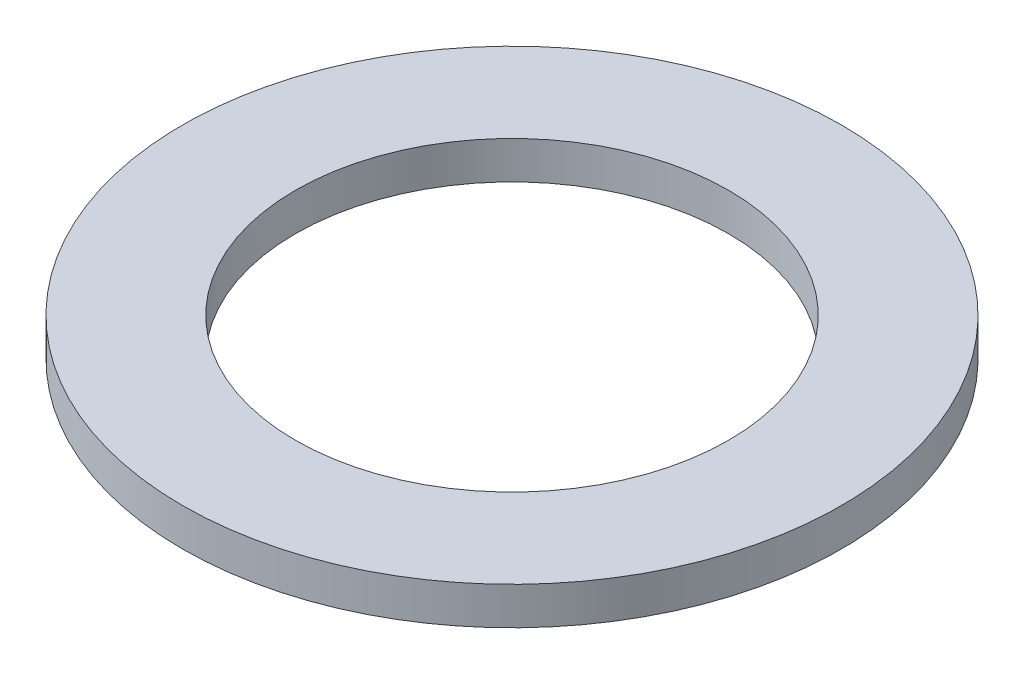
ISO-10303-21;
HEADER;
FILE_DESCRIPTION(('STEP AP214'),'2;1');
FILE_NAME('part.step','',(''),(''),'','','');
FILE_SCHEMA(('AUTOMOTIVE_DESIGN { 1 0 10303 214 1 1 1 1 }'));
ENDSEC;
DATA;
#1=APPLICATION_CONTEXT('core data for automotive mechanical design processes');
#2=APPLICATION_PROTOCOL_DEFINITION('international standard','automotive_design',2000,#1);
#3=PRODUCT_CONTEXT('',#1,'mechanical');
#4=PRODUCT('Part','Part','',(#3));
#5=PRODUCT_RELATED_PRODUCT_CATEGORY('part','',(#4));
#6=PRODUCT_DEFINITION_FORMATION('','',#4);
#7=PRODUCT_DEFINITION_CONTEXT('part definition',#1,'design');
#8=PRODUCT_DEFINITION('design','',#6,#7);
#9=PRODUCT_DEFINITION_SHAPE('','',#8);
#10=(LENGTH_UNIT() NAMED_UNIT(*) SI_UNIT(.MILLI.,.METRE.));
#11=(NAMED_UNIT(*) PLANE_ANGLE_UNIT() SI_UNIT($,.RADIAN.));
#12=(NAMED_UNIT(*) SI_UNIT($,.STERADIAN.) SOLID_ANGLE_UNIT());
#13=UNCERTAINTY_MEASURE_WITH_UNIT(LENGTH_MEASURE(1.E-05),#10,'distance_accuracy_value','');
#14=(GEOMETRIC_REPRESENTATION_CONTEXT(3) GLOBAL_UNCERTAINTY_ASSIGNED_CONTEXT((#13)) GLOBAL_UNIT_ASSIGNED_CONTEXT((#10,
#11,#12)) REPRESENTATION_CONTEXT('',''));
#15=CARTESIAN_POINT('',(0.,0.,0.));
#16=DIRECTION('',(0.,0.,1.));
#17=DIRECTION('',(1.,0.,0.));
#18=AXIS2_PLACEMENT_3D('',#15,#16,#17);
#19=CARTESIAN_POINT('',(0.,0.2,0.));
#20=DIRECTION('',(0.,1.,0.));
#21=DIRECTION('',(0.,0.,1.));
#22=AXIS2_PLACEMENT_3D('',#19,#20,#21);
#23=PLANE('',#22);
#24=CARTESIAN_POINT('',(0.,0.2,0.));
#25=DIRECTION('',(0.,1.,0.));
#26=DIRECTION('',(0.,0.,1.));
#27=AXIS2_PLACEMENT_3D('',#24,#25,#26);
#28=CIRCLE('',#27,1.75);
#29=CARTESIAN_POINT('',(0.,0.2,1.75));
#30=VERTEX_POINT('',#29);
#31=EDGE_CURVE('E10',#30,#30,#28,.T.);
#32=ORIENTED_EDGE('',*,*,#31,.T.);
#33=EDGE_LOOP('',(#32));
#34=FACE_BOUND('',#33,.T.);
#35=CARTESIAN_POINT('',(0.,0.2,0.));
#36=DIRECTION('',(0.,1.,0.));
#37=DIRECTION('',(0.,0.,1.));
#38=AXIS2_PLACEMENT_3D('',#35,#36,#37);
#39=CIRCLE('',#38,1.15);
#40=CARTESIAN_POINT('',(0.,0.2,1.15));
#41=VERTEX_POINT('',#40);
#42=EDGE_CURVE('E44',#41,#41,#39,.T.);
#43=ORIENTED_EDGE('',*,*,#42,.F.);
#44=EDGE_LOOP('',(#43));
#45=FACE_BOUND('',#44,.T.);
#46=ADVANCED_FACE('F33',(#34,#45),#23,.T.);
#47=CARTESIAN_POINT('',(0.,0.,0.));
#48=DIRECTION('',(0.,1.,0.));
#49=DIRECTION('',(0.,0.,1.));
#50=AXIS2_PLACEMENT_3D('',#47,#48,#49);
#51=PLANE('',#50);
#52=CARTESIAN_POINT('',(0.,0.,0.));
#53=DIRECTION('',(0.,1.,0.));
#54=DIRECTION('',(0.,0.,1.));
#55=AXIS2_PLACEMENT_3D('',#52,#53,#54);
#56=CIRCLE('',#55,1.75);
#57=CARTESIAN_POINT('',(0.,0.,1.75));
#58=VERTEX_POINT('',#57);
#59=EDGE_CURVE('E37',#58,#58,#56,.T.);
#60=ORIENTED_EDGE('',*,*,#59,.F.);
#61=EDGE_LOOP('',(#60));
#62=FACE_BOUND('',#61,.T.);
#63=CARTESIAN_POINT('',(0.,0.,0.));
#64=DIRECTION('',(0.,1.,0.));
#65=DIRECTION('',(0.,0.,1.));
#66=AXIS2_PLACEMENT_3D('',#63,#64,#65);
#67=CIRCLE('',#66,1.15);
#68=CARTESIAN_POINT('',(0.,0.,1.15));
#69=VERTEX_POINT('',#68);
#70=EDGE_CURVE('E46',#69,#69,#67,.T.);
#71=ORIENTED_EDGE('',*,*,#70,.T.);
#72=EDGE_LOOP('',(#71));
#73=FACE_BOUND('',#72,.T.);
#74=ADVANCED_FACE('F56',(#62,#73),#51,.F.);
#75=CARTESIAN_POINT('',(0.,0.2,0.));
#76=DIRECTION('',(0.,-1.,0.));
#77=DIRECTION('',(0.,0.,-1.));
#78=AXIS2_PLACEMENT_3D('',#75,#76,#77);
#79=CYLINDRICAL_SURFACE('',#78,1.75);
#80=ORIENTED_EDGE('',*,*,#31,.F.);
#81=EDGE_LOOP('',(#80));
#82=FACE_BOUND('',#81,.T.);
#83=ORIENTED_EDGE('',*,*,#59,.T.);
#84=EDGE_LOOP('',(#83));
#85=FACE_BOUND('',#84,.T.);
#86=ADVANCED_FACE('F35',(#82,#85),#79,.T.);
#87=CARTESIAN_POINT('',(0.,0.2,0.));
#88=DIRECTION('',(0.,-1.,0.));
#89=DIRECTION('',(0.,0.,-1.));
#90=AXIS2_PLACEMENT_3D('',#87,#88,#89);
#91=CYLINDRICAL_SURFACE('',#90,1.15);
#92=ORIENTED_EDGE('',*,*,#42,.T.);
#93=EDGE_LOOP('',(#92));
#94=FACE_BOUND('',#93,.T.);
#95=ORIENTED_EDGE('',*,*,#70,.F.);
#96=EDGE_LOOP('',(#95));
#97=FACE_BOUND('',#96,.T.);
#98=ADVANCED_FACE('F52',(#94,#97),#91,.F.);
#99=CLOSED_SHELL('',(#46,#74,#86,#98));
#100=MANIFOLD_SOLID_BREP('B2',#99);
#101=ADVANCED_BREP_SHAPE_REPRESENTATION('',(#18,#100),#14);
#102=SHAPE_DEFINITION_REPRESENTATION(#9,#101);
ENDSEC;
END-ISO-10303-21;
